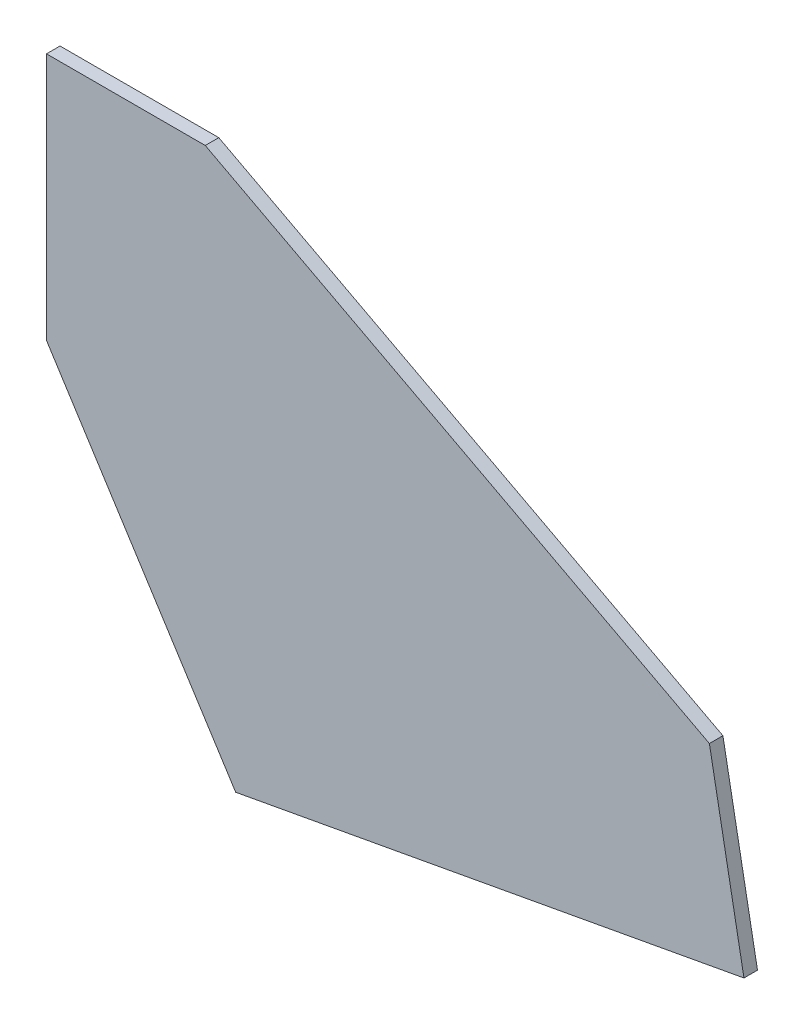
ISO-10303-21;
HEADER;
FILE_DESCRIPTION(('STEP AP214'),'2;1');
FILE_NAME('part.step','',(''),(''),'','','');
FILE_SCHEMA(('AUTOMOTIVE_DESIGN { 1 0 10303 214 1 1 1 1 }'));
ENDSEC;
DATA;
#1=APPLICATION_CONTEXT('core data for automotive mechanical design processes');
#2=APPLICATION_PROTOCOL_DEFINITION('international standard','automotive_design',2000,#1);
#3=PRODUCT_CONTEXT('',#1,'mechanical');
#4=PRODUCT('Part','Part','',(#3));
#5=PRODUCT_RELATED_PRODUCT_CATEGORY('part','',(#4));
#6=PRODUCT_DEFINITION_FORMATION('','',#4);
#7=PRODUCT_DEFINITION_CONTEXT('part definition',#1,'design');
#8=PRODUCT_DEFINITION('design','',#6,#7);
#9=PRODUCT_DEFINITION_SHAPE('','',#8);
#10=(LENGTH_UNIT() NAMED_UNIT(*) SI_UNIT(.MILLI.,.METRE.));
#11=(NAMED_UNIT(*) PLANE_ANGLE_UNIT() SI_UNIT($,.RADIAN.));
#12=(NAMED_UNIT(*) SI_UNIT($,.STERADIAN.) SOLID_ANGLE_UNIT());
#13=UNCERTAINTY_MEASURE_WITH_UNIT(LENGTH_MEASURE(1.E-05),#10,'distance_accuracy_value','');
#14=(GEOMETRIC_REPRESENTATION_CONTEXT(3) GLOBAL_UNCERTAINTY_ASSIGNED_CONTEXT((#13)) GLOBAL_UNIT_ASSIGNED_CONTEXT((#10,
#11,#12)) REPRESENTATION_CONTEXT('',''));
#15=CARTESIAN_POINT('',(0.,0.,0.));
#16=DIRECTION('',(0.,0.,1.));
#17=DIRECTION('',(1.,0.,0.));
#18=AXIS2_PLACEMENT_3D('',#15,#16,#17);
#19=CARTESIAN_POINT('',(620.785792455521,-932.156619673691,3.81));
#20=DIRECTION('',(0.843184459672713,0.537624373486205,0.));
#21=DIRECTION('',(-0.537624373486205,0.843184459672713,0.));
#22=AXIS2_PLACEMENT_3D('',#19,#20,#21);
#23=PLANE('',#22);
#24=DIRECTION('',(0.537624373486205,-0.843184459672713,0.));
#25=VECTOR('',#24,1.);
#26=CARTESIAN_POINT('',(620.785792455521,-932.156619673691,0.));
#27=LINE('',#26,#25);
#28=CARTESIAN_POINT('',(620.785792455521,-932.156619673691,0.));
#29=VERTEX_POINT('',#28);
#30=CARTESIAN_POINT('',(674.030273867871,-1015.66272822139,0.));
#31=VERTEX_POINT('',#30);
#32=EDGE_CURVE('E116',#29,#31,#27,.T.);
#33=ORIENTED_EDGE('',*,*,#32,.T.);
#34=DIRECTION('',(0.,0.,-1.));
#35=VECTOR('',#34,1.);
#36=CARTESIAN_POINT('',(674.030273867871,-1015.66272822139,3.81));
#37=LINE('',#36,#35);
#38=CARTESIAN_POINT('',(674.030273867871,-1015.66272822139,3.81));
#39=VERTEX_POINT('',#38);
#40=EDGE_CURVE('E11',#39,#31,#37,.T.);
#41=ORIENTED_EDGE('',*,*,#40,.F.);
#42=DIRECTION('',(0.537624373486205,-0.843184459672713,0.));
#43=VECTOR('',#42,1.);
#44=CARTESIAN_POINT('',(620.785792455521,-932.156619673691,3.81));
#45=LINE('',#44,#43);
#46=CARTESIAN_POINT('',(620.785792455521,-932.156619673691,3.81));
#47=VERTEX_POINT('',#46);
#48=EDGE_CURVE('E126',#47,#39,#45,.T.);
#49=ORIENTED_EDGE('',*,*,#48,.F.);
#50=DIRECTION('',(0.,0.,-1.));
#51=VECTOR('',#50,1.);
#52=CARTESIAN_POINT('',(620.785792455521,-932.156619673691,3.81));
#53=LINE('',#52,#51);
#54=EDGE_CURVE('E112',#47,#29,#53,.T.);
#55=ORIENTED_EDGE('',*,*,#54,.T.);
#56=EDGE_LOOP('',(#33,#41,#49,#55));
#57=FACE_BOUND('',#56,.T.);
#58=ADVANCED_FACE('F32',(#57),#23,.F.);
#59=CARTESIAN_POINT('',(674.030273867871,-1015.66272822139,3.81));
#60=DIRECTION('',(-0.180507151128542,0.983573672071115,0.));
#61=DIRECTION('',(-0.983573672071115,-0.180507151128542,0.));
#62=AXIS2_PLACEMENT_3D('',#59,#60,#61);
#63=PLANE('',#62);
#64=DIRECTION('',(0.983573672071115,0.180507151128542,0.));
#65=VECTOR('',#64,1.);
#66=CARTESIAN_POINT('',(674.030273867871,-1015.66272822139,0.));
#67=LINE('',#66,#65);
#68=CARTESIAN_POINT('',(817.091732774443,-989.407840441459,0.));
#69=VERTEX_POINT('',#68);
#70=EDGE_CURVE('E119',#31,#69,#67,.T.);
#71=ORIENTED_EDGE('',*,*,#70,.T.);
#72=DIRECTION('',(0.,0.,-1.));
#73=VECTOR('',#72,1.);
#74=CARTESIAN_POINT('',(817.091732774443,-989.407840441459,3.81));
#75=LINE('',#74,#73);
#76=CARTESIAN_POINT('',(817.091732774443,-989.407840441459,3.81));
#77=VERTEX_POINT('',#76);
#78=EDGE_CURVE('E40',#77,#69,#75,.T.);
#79=ORIENTED_EDGE('',*,*,#78,.F.);
#80=DIRECTION('',(0.983573672071115,0.180507151128542,0.));
#81=VECTOR('',#80,1.);
#82=CARTESIAN_POINT('',(674.030273867871,-1015.66272822139,3.81));
#83=LINE('',#82,#81);
#84=EDGE_CURVE('E85',#39,#77,#83,.T.);
#85=ORIENTED_EDGE('',*,*,#84,.F.);
#86=ORIENTED_EDGE('',*,*,#40,.T.);
#87=EDGE_LOOP('',(#71,#79,#85,#86));
#88=FACE_BOUND('',#87,.T.);
#89=ADVANCED_FACE('F150',(#88),#63,.F.);
#90=CARTESIAN_POINT('',(817.091732774443,-989.407840441459,3.81));
#91=DIRECTION('',(-0.983121597467128,-0.182953339935852,0.));
#92=DIRECTION('',(0.182953339935852,-0.983121597467128,0.));
#93=AXIS2_PLACEMENT_3D('',#90,#91,#92);
#94=PLANE('',#93);
#95=DIRECTION('',(-0.182953339935852,0.983121597467127,0.));
#96=VECTOR('',#95,1.);
#97=CARTESIAN_POINT('',(817.091732774443,-989.407840441459,0.));
#98=LINE('',#97,#96);
#99=CARTESIAN_POINT('',(807.360598060626,-937.116427186197,0.));
#100=VERTEX_POINT('',#99);
#101=EDGE_CURVE('E121',#69,#100,#98,.T.);
#102=ORIENTED_EDGE('',*,*,#101,.T.);
#103=DIRECTION('',(0.,0.,-1.));
#104=VECTOR('',#103,1.);
#105=CARTESIAN_POINT('',(807.360598060626,-937.116427186197,3.81));
#106=LINE('',#105,#104);
#107=CARTESIAN_POINT('',(807.360598060626,-937.116427186197,3.81));
#108=VERTEX_POINT('',#107);
#109=EDGE_CURVE('E107',#108,#100,#106,.T.);
#110=ORIENTED_EDGE('',*,*,#109,.F.);
#111=DIRECTION('',(-0.182953339935852,0.983121597467127,0.));
#112=VECTOR('',#111,1.);
#113=CARTESIAN_POINT('',(817.091732774443,-989.407840441459,3.81));
#114=LINE('',#113,#112);
#115=EDGE_CURVE('E98',#77,#108,#114,.T.);
#116=ORIENTED_EDGE('',*,*,#115,.F.);
#117=ORIENTED_EDGE('',*,*,#78,.T.);
#118=EDGE_LOOP('',(#102,#110,#116,#117));
#119=FACE_BOUND('',#118,.T.);
#120=ADVANCED_FACE('F132',(#119),#94,.F.);
#121=CARTESIAN_POINT('',(807.360598060626,-937.116427186197,3.81));
#122=DIRECTION('',(-0.466459886798644,-0.884542352862652,0.));
#123=DIRECTION('',(0.884542352862652,-0.466459886798645,0.));
#124=AXIS2_PLACEMENT_3D('',#121,#122,#123);
#125=PLANE('',#124);
#126=DIRECTION('',(-0.884542352862652,0.466459886798645,0.));
#127=VECTOR('',#126,1.);
#128=CARTESIAN_POINT('',(807.360598060626,-937.116427186197,0.));
#129=LINE('',#128,#127);
#130=CARTESIAN_POINT('',(665.469814468452,-862.290887585999,0.));
#131=VERTEX_POINT('',#130);
#132=EDGE_CURVE('E106',#100,#131,#129,.T.);
#133=ORIENTED_EDGE('',*,*,#132,.T.);
#134=DIRECTION('',(0.,0.,-1.));
#135=VECTOR('',#134,1.);
#136=CARTESIAN_POINT('',(665.469814468452,-862.290887585999,3.81));
#137=LINE('',#136,#135);
#138=CARTESIAN_POINT('',(665.469814468452,-862.290887585999,3.81));
#139=VERTEX_POINT('',#138);
#140=EDGE_CURVE('E103',#139,#131,#137,.T.);
#141=ORIENTED_EDGE('',*,*,#140,.F.);
#142=DIRECTION('',(-0.884542352862652,0.466459886798645,0.));
#143=VECTOR('',#142,1.);
#144=CARTESIAN_POINT('',(807.360598060626,-937.116427186197,3.81));
#145=LINE('',#144,#143);
#146=EDGE_CURVE('E92',#108,#139,#145,.T.);
#147=ORIENTED_EDGE('',*,*,#146,.F.);
#148=ORIENTED_EDGE('',*,*,#109,.T.);
#149=EDGE_LOOP('',(#133,#141,#147,#148));
#150=FACE_BOUND('',#149,.T.);
#151=ADVANCED_FACE('F104',(#150),#125,.F.);
#152=CARTESIAN_POINT('',(665.469814468452,-862.290887585999,3.81));
#153=DIRECTION('',(0.,-1.,0.));
#154=DIRECTION('',(0.,0.,-1.));
#155=AXIS2_PLACEMENT_3D('',#152,#153,#154);
#156=PLANE('',#155);
#157=DIRECTION('',(-1.,0.,0.));
#158=VECTOR('',#157,1.);
#159=CARTESIAN_POINT('',(665.469814468452,-862.290887585999,0.));
#160=LINE('',#159,#158);
#161=CARTESIAN_POINT('',(620.785792455521,-862.290887585999,0.));
#162=VERTEX_POINT('',#161);
#163=EDGE_CURVE('E71',#131,#162,#160,.T.);
#164=ORIENTED_EDGE('',*,*,#163,.T.);
#165=DIRECTION('',(0.,0.,-1.));
#166=VECTOR('',#165,1.);
#167=CARTESIAN_POINT('',(620.785792455521,-862.290887585999,3.81));
#168=LINE('',#167,#166);
#169=CARTESIAN_POINT('',(620.785792455521,-862.290887585999,3.81));
#170=VERTEX_POINT('',#169);
#171=EDGE_CURVE('E108',#170,#162,#168,.T.);
#172=ORIENTED_EDGE('',*,*,#171,.F.);
#173=DIRECTION('',(-1.,0.,0.));
#174=VECTOR('',#173,1.);
#175=CARTESIAN_POINT('',(665.469814468452,-862.290887585999,3.81));
#176=LINE('',#175,#174);
#177=EDGE_CURVE('E96',#139,#170,#176,.T.);
#178=ORIENTED_EDGE('',*,*,#177,.F.);
#179=ORIENTED_EDGE('',*,*,#140,.T.);
#180=EDGE_LOOP('',(#164,#172,#178,#179));
#181=FACE_BOUND('',#180,.T.);
#182=ADVANCED_FACE('F110',(#181),#156,.F.);
#183=CARTESIAN_POINT('',(620.785792455521,-862.290887585999,3.81));
#184=DIRECTION('',(1.,0.,0.));
#185=DIRECTION('',(0.,0.,-1.));
#186=AXIS2_PLACEMENT_3D('',#183,#184,#185);
#187=PLANE('',#186);
#188=DIRECTION('',(0.,-1.,0.));
#189=VECTOR('',#188,1.);
#190=CARTESIAN_POINT('',(620.785792455521,-862.290887585999,0.));
#191=LINE('',#190,#189);
#192=EDGE_CURVE('E77',#162,#29,#191,.T.);
#193=ORIENTED_EDGE('',*,*,#192,.T.);
#194=ORIENTED_EDGE('',*,*,#54,.F.);
#195=DIRECTION('',(0.,-1.,0.));
#196=VECTOR('',#195,1.);
#197=CARTESIAN_POINT('',(620.785792455521,-862.290887585999,3.81));
#198=LINE('',#197,#196);
#199=EDGE_CURVE('E48',#170,#47,#198,.T.);
#200=ORIENTED_EDGE('',*,*,#199,.F.);
#201=ORIENTED_EDGE('',*,*,#171,.T.);
#202=EDGE_LOOP('',(#193,#194,#200,#201));
#203=FACE_BOUND('',#202,.T.);
#204=ADVANCED_FACE('F139',(#203),#187,.F.);
#205=CARTESIAN_POINT('',(0.,0.,3.81));
#206=DIRECTION('',(0.,0.,1.));
#207=DIRECTION('',(1.,0.,0.));
#208=AXIS2_PLACEMENT_3D('',#205,#206,#207);
#209=PLANE('',#208);
#210=ORIENTED_EDGE('',*,*,#48,.T.);
#211=ORIENTED_EDGE('',*,*,#84,.T.);
#212=ORIENTED_EDGE('',*,*,#115,.T.);
#213=ORIENTED_EDGE('',*,*,#146,.T.);
#214=ORIENTED_EDGE('',*,*,#177,.T.);
#215=ORIENTED_EDGE('',*,*,#199,.T.);
#216=EDGE_LOOP('',(#210,#211,#212,#213,#214,#215));
#217=FACE_BOUND('',#216,.T.);
#218=ADVANCED_FACE('F94',(#217),#209,.T.);
#219=CARTESIAN_POINT('',(0.,0.,0.));
#220=DIRECTION('',(0.,0.,1.));
#221=DIRECTION('',(1.,0.,0.));
#222=AXIS2_PLACEMENT_3D('',#219,#220,#221);
#223=PLANE('',#222);
#224=ORIENTED_EDGE('',*,*,#32,.F.);
#225=ORIENTED_EDGE('',*,*,#192,.F.);
#226=ORIENTED_EDGE('',*,*,#163,.F.);
#227=ORIENTED_EDGE('',*,*,#132,.F.);
#228=ORIENTED_EDGE('',*,*,#101,.F.);
#229=ORIENTED_EDGE('',*,*,#70,.F.);
#230=EDGE_LOOP('',(#224,#225,#226,#227,#228,#229));
#231=FACE_BOUND('',#230,.T.);
#232=ADVANCED_FACE('F135',(#231),#223,.F.);
#233=CLOSED_SHELL('',(#58,#89,#120,#151,#182,#204,#218,#232));
#234=MANIFOLD_SOLID_BREP('B2',#233);
#235=ADVANCED_BREP_SHAPE_REPRESENTATION('',(#18,#234),#14);
#236=SHAPE_DEFINITION_REPRESENTATION(#9,#235);
ENDSEC;
END-ISO-10303-21;
